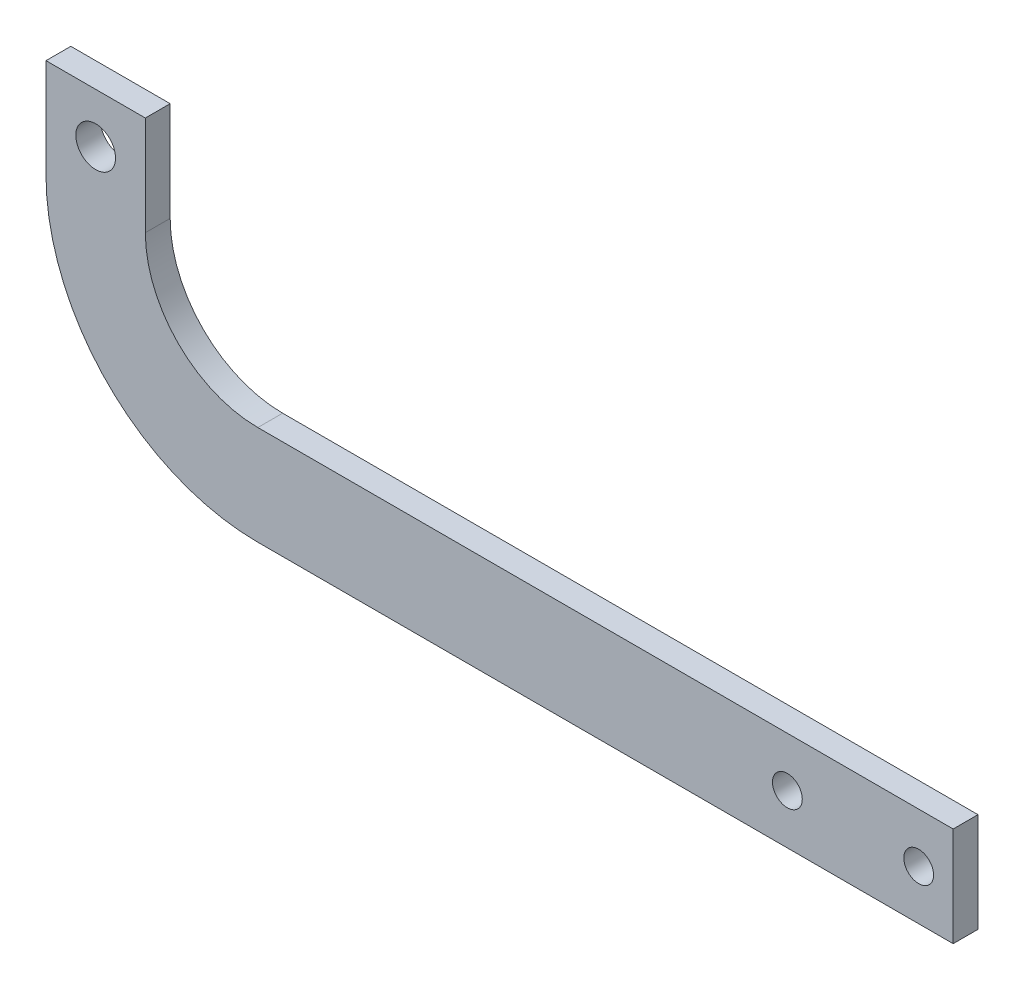
ISO-10303-21;
HEADER;
FILE_DESCRIPTION(('STEP AP214'),'2;1');
FILE_NAME('part.step','',(''),(''),'','','');
FILE_SCHEMA(('AUTOMOTIVE_DESIGN { 1 0 10303 214 1 1 1 1 }'));
ENDSEC;
DATA;
#1=APPLICATION_CONTEXT('core data for automotive mechanical design processes');
#2=APPLICATION_PROTOCOL_DEFINITION('international standard','automotive_design',2000,#1);
#3=PRODUCT_CONTEXT('',#1,'mechanical');
#4=PRODUCT('Part','Part','',(#3));
#5=PRODUCT_RELATED_PRODUCT_CATEGORY('part','',(#4));
#6=PRODUCT_DEFINITION_FORMATION('','',#4);
#7=PRODUCT_DEFINITION_CONTEXT('part definition',#1,'design');
#8=PRODUCT_DEFINITION('design','',#6,#7);
#9=PRODUCT_DEFINITION_SHAPE('','',#8);
#10=(LENGTH_UNIT() NAMED_UNIT(*) SI_UNIT(.MILLI.,.METRE.));
#11=(NAMED_UNIT(*) PLANE_ANGLE_UNIT() SI_UNIT($,.RADIAN.));
#12=(NAMED_UNIT(*) SI_UNIT($,.STERADIAN.) SOLID_ANGLE_UNIT());
#13=UNCERTAINTY_MEASURE_WITH_UNIT(LENGTH_MEASURE(1.E-05),#10,'distance_accuracy_value','');
#14=(GEOMETRIC_REPRESENTATION_CONTEXT(3) GLOBAL_UNCERTAINTY_ASSIGNED_CONTEXT((#13)) GLOBAL_UNIT_ASSIGNED_CONTEXT((#10,
#11,#12)) REPRESENTATION_CONTEXT('',''));
#15=CARTESIAN_POINT('',(0.,0.,0.));
#16=DIRECTION('',(0.,0.,1.));
#17=DIRECTION('',(1.,0.,0.));
#18=AXIS2_PLACEMENT_3D('',#15,#16,#17);
#19=CARTESIAN_POINT('',(0.,21.3237521470741,2.5));
#20=DIRECTION('',(0.,0.,1.));
#21=DIRECTION('',(1.,0.,0.));
#22=AXIS2_PLACEMENT_3D('',#19,#20,#21);
#23=PLANE('',#22);
#24=CARTESIAN_POINT('',(66.53,5.,2.5));
#25=DIRECTION('',(0.,0.,1.));
#26=DIRECTION('',(1.,0.,0.));
#27=AXIS2_PLACEMENT_3D('',#24,#25,#26);
#28=CIRCLE('',#27,1.5);
#29=CARTESIAN_POINT('',(68.03,5.,2.5));
#30=VERTEX_POINT('',#29);
#31=EDGE_CURVE('E182',#30,#30,#28,.T.);
#32=ORIENTED_EDGE('',*,*,#31,.F.);
#33=EDGE_LOOP('',(#32));
#34=FACE_BOUND('',#33,.T.);
#35=CARTESIAN_POINT('',(0.,21.3237521470741,2.5));
#36=DIRECTION('',(0.,0.,1.));
#37=DIRECTION('',(1.,0.,0.));
#38=AXIS2_PLACEMENT_3D('',#35,#36,#37);
#39=CIRCLE('',#38,21.3237521470741);
#40=CARTESIAN_POINT('',(-21.3237521470741,21.3237521470741,2.5));
#41=VERTEX_POINT('',#40);
#42=CARTESIAN_POINT('',(0.,0.,2.5));
#43=VERTEX_POINT('',#42);
#44=EDGE_CURVE('E145',#41,#43,#39,.T.);
#45=ORIENTED_EDGE('',*,*,#44,.T.);
#46=DIRECTION('',(1.,0.,0.));
#47=VECTOR('',#46,1.);
#48=CARTESIAN_POINT('',(0.,0.,2.5));
#49=LINE('',#48,#47);
#50=CARTESIAN_POINT('',(70.,0.,2.5));
#51=VERTEX_POINT('',#50);
#52=EDGE_CURVE('E93',#43,#51,#49,.T.);
#53=ORIENTED_EDGE('',*,*,#52,.T.);
#54=DIRECTION('',(0.,1.,0.));
#55=VECTOR('',#54,1.);
#56=CARTESIAN_POINT('',(70.,0.,2.5));
#57=LINE('',#56,#55);
#58=CARTESIAN_POINT('',(70.,10.,2.5));
#59=VERTEX_POINT('',#58);
#60=EDGE_CURVE('E160',#51,#59,#57,.T.);
#61=ORIENTED_EDGE('',*,*,#60,.T.);
#62=DIRECTION('',(-1.,0.,0.));
#63=VECTOR('',#62,1.);
#64=CARTESIAN_POINT('',(0.,10.,2.5));
#65=LINE('',#64,#63);
#66=CARTESIAN_POINT('',(0.,10.,2.5));
#67=VERTEX_POINT('',#66);
#68=EDGE_CURVE('E173',#59,#67,#65,.T.);
#69=ORIENTED_EDGE('',*,*,#68,.T.);
#70=CARTESIAN_POINT('',(0.,21.3237521470741,2.5));
#71=DIRECTION('',(0.,0.,-1.));
#72=DIRECTION('',(1.,0.,0.));
#73=AXIS2_PLACEMENT_3D('',#70,#71,#72);
#74=CIRCLE('',#73,11.3237521470741);
#75=CARTESIAN_POINT('',(-11.3237521470741,21.3237521470741,2.5));
#76=VERTEX_POINT('',#75);
#77=EDGE_CURVE('E112',#67,#76,#74,.T.);
#78=ORIENTED_EDGE('',*,*,#77,.T.);
#79=DIRECTION('',(0.,1.,0.));
#80=VECTOR('',#79,1.);
#81=CARTESIAN_POINT('',(-11.3237521470741,31.3237521470741,2.5));
#82=LINE('',#81,#80);
#83=CARTESIAN_POINT('',(-11.3237521470741,31.3237521470741,2.5));
#84=VERTEX_POINT('',#83);
#85=EDGE_CURVE('E106',#76,#84,#82,.T.);
#86=ORIENTED_EDGE('',*,*,#85,.T.);
#87=DIRECTION('',(-1.,0.,0.));
#88=VECTOR('',#87,1.);
#89=CARTESIAN_POINT('',(-21.3237521470741,31.3237521470741,2.5));
#90=LINE('',#89,#88);
#91=CARTESIAN_POINT('',(-21.3237521470741,31.3237521470741,2.5));
#92=VERTEX_POINT('',#91);
#93=EDGE_CURVE('E110',#84,#92,#90,.T.);
#94=ORIENTED_EDGE('',*,*,#93,.T.);
#95=DIRECTION('',(0.,-1.,0.));
#96=VECTOR('',#95,1.);
#97=CARTESIAN_POINT('',(-21.3237521470741,21.3237521470741,2.5));
#98=LINE('',#97,#96);
#99=EDGE_CURVE('E50',#92,#41,#98,.T.);
#100=ORIENTED_EDGE('',*,*,#99,.T.);
#101=EDGE_LOOP('',(#45,#53,#61,#69,#78,#86,#94,#100));
#102=FACE_BOUND('',#101,.T.);
#103=CARTESIAN_POINT('',(-16.3237521470741,26.3237521470741,2.5));
#104=DIRECTION('',(0.,0.,1.));
#105=DIRECTION('',(1.,0.,0.));
#106=AXIS2_PLACEMENT_3D('',#103,#104,#105);
#107=CIRCLE('',#106,2.);
#108=CARTESIAN_POINT('',(-14.3237521470741,26.3237521470741,2.5));
#109=VERTEX_POINT('',#108);
#110=EDGE_CURVE('E134',#109,#109,#107,.T.);
#111=ORIENTED_EDGE('',*,*,#110,.F.);
#112=EDGE_LOOP('',(#111));
#113=FACE_BOUND('',#112,.T.);
#114=CARTESIAN_POINT('',(53.31,5.,2.5));
#115=DIRECTION('',(0.,0.,1.));
#116=DIRECTION('',(1.,0.,0.));
#117=AXIS2_PLACEMENT_3D('',#114,#115,#116);
#118=CIRCLE('',#117,1.5);
#119=CARTESIAN_POINT('',(54.81,5.,2.5));
#120=VERTEX_POINT('',#119);
#121=EDGE_CURVE('E188',#120,#120,#118,.T.);
#122=ORIENTED_EDGE('',*,*,#121,.F.);
#123=EDGE_LOOP('',(#122));
#124=FACE_BOUND('',#123,.T.);
#125=ADVANCED_FACE('F33',(#34,#102,#113,#124),#23,.T.);
#126=CARTESIAN_POINT('',(0.,21.3237521470741,0.));
#127=DIRECTION('',(0.,0.,1.));
#128=DIRECTION('',(1.,0.,0.));
#129=AXIS2_PLACEMENT_3D('',#126,#127,#128);
#130=PLANE('',#129);
#131=CARTESIAN_POINT('',(0.,21.3237521470741,0.));
#132=DIRECTION('',(0.,0.,1.));
#133=DIRECTION('',(1.,0.,0.));
#134=AXIS2_PLACEMENT_3D('',#131,#132,#133);
#135=CIRCLE('',#134,21.3237521470741);
#136=CARTESIAN_POINT('',(-21.3237521470741,21.3237521470741,0.));
#137=VERTEX_POINT('',#136);
#138=CARTESIAN_POINT('',(0.,0.,0.));
#139=VERTEX_POINT('',#138);
#140=EDGE_CURVE('E130',#137,#139,#135,.T.);
#141=ORIENTED_EDGE('',*,*,#140,.F.);
#142=DIRECTION('',(0.,-1.,0.));
#143=VECTOR('',#142,1.);
#144=CARTESIAN_POINT('',(-21.3237521470741,21.3237521470741,0.));
#145=LINE('',#144,#143);
#146=CARTESIAN_POINT('',(-21.3237521470741,31.3237521470741,0.));
#147=VERTEX_POINT('',#146);
#148=EDGE_CURVE('E85',#147,#137,#145,.T.);
#149=ORIENTED_EDGE('',*,*,#148,.F.);
#150=DIRECTION('',(-1.,0.,0.));
#151=VECTOR('',#150,1.);
#152=CARTESIAN_POINT('',(-21.3237521470741,31.3237521470741,0.));
#153=LINE('',#152,#151);
#154=CARTESIAN_POINT('',(-11.3237521470741,31.3237521470741,0.));
#155=VERTEX_POINT('',#154);
#156=EDGE_CURVE('E79',#155,#147,#153,.T.);
#157=ORIENTED_EDGE('',*,*,#156,.F.);
#158=DIRECTION('',(0.,1.,0.));
#159=VECTOR('',#158,1.);
#160=CARTESIAN_POINT('',(-11.3237521470741,31.3237521470741,0.));
#161=LINE('',#160,#159);
#162=CARTESIAN_POINT('',(-11.3237521470741,21.3237521470741,0.));
#163=VERTEX_POINT('',#162);
#164=EDGE_CURVE('E120',#163,#155,#161,.T.);
#165=ORIENTED_EDGE('',*,*,#164,.F.);
#166=CARTESIAN_POINT('',(0.,21.3237521470741,0.));
#167=DIRECTION('',(0.,0.,-1.));
#168=DIRECTION('',(1.,0.,0.));
#169=AXIS2_PLACEMENT_3D('',#166,#167,#168);
#170=CIRCLE('',#169,11.3237521470741);
#171=CARTESIAN_POINT('',(0.,10.,0.));
#172=VERTEX_POINT('',#171);
#173=EDGE_CURVE('E140',#172,#163,#170,.T.);
#174=ORIENTED_EDGE('',*,*,#173,.F.);
#175=DIRECTION('',(-1.,0.,0.));
#176=VECTOR('',#175,1.);
#177=CARTESIAN_POINT('',(0.,10.,0.));
#178=LINE('',#177,#176);
#179=CARTESIAN_POINT('',(70.,10.,0.));
#180=VERTEX_POINT('',#179);
#181=EDGE_CURVE('E138',#180,#172,#178,.T.);
#182=ORIENTED_EDGE('',*,*,#181,.F.);
#183=DIRECTION('',(0.,1.,0.));
#184=VECTOR('',#183,1.);
#185=CARTESIAN_POINT('',(70.,0.,0.));
#186=LINE('',#185,#184);
#187=CARTESIAN_POINT('',(70.,0.,0.));
#188=VERTEX_POINT('',#187);
#189=EDGE_CURVE('E136',#188,#180,#186,.T.);
#190=ORIENTED_EDGE('',*,*,#189,.F.);
#191=DIRECTION('',(1.,0.,0.));
#192=VECTOR('',#191,1.);
#193=CARTESIAN_POINT('',(0.,0.,0.));
#194=LINE('',#193,#192);
#195=EDGE_CURVE('E133',#139,#188,#194,.T.);
#196=ORIENTED_EDGE('',*,*,#195,.F.);
#197=EDGE_LOOP('',(#141,#149,#157,#165,#174,#182,#190,#196));
#198=FACE_BOUND('',#197,.T.);
#199=CARTESIAN_POINT('',(-16.3237521470741,26.3237521470741,0.));
#200=DIRECTION('',(0.,0.,1.));
#201=DIRECTION('',(1.,0.,0.));
#202=AXIS2_PLACEMENT_3D('',#199,#200,#201);
#203=CIRCLE('',#202,2.);
#204=CARTESIAN_POINT('',(-14.3237521470741,26.3237521470741,0.));
#205=VERTEX_POINT('',#204);
#206=EDGE_CURVE('E179',#205,#205,#203,.T.);
#207=ORIENTED_EDGE('',*,*,#206,.T.);
#208=EDGE_LOOP('',(#207));
#209=FACE_BOUND('',#208,.T.);
#210=CARTESIAN_POINT('',(66.53,5.,0.));
#211=DIRECTION('',(0.,0.,1.));
#212=DIRECTION('',(1.,0.,0.));
#213=AXIS2_PLACEMENT_3D('',#210,#211,#212);
#214=CIRCLE('',#213,1.5);
#215=CARTESIAN_POINT('',(68.03,5.,0.));
#216=VERTEX_POINT('',#215);
#217=EDGE_CURVE('E185',#216,#216,#214,.T.);
#218=ORIENTED_EDGE('',*,*,#217,.T.);
#219=EDGE_LOOP('',(#218));
#220=FACE_BOUND('',#219,.T.);
#221=CARTESIAN_POINT('',(53.31,5.,0.));
#222=DIRECTION('',(0.,0.,1.));
#223=DIRECTION('',(1.,0.,0.));
#224=AXIS2_PLACEMENT_3D('',#221,#222,#223);
#225=CIRCLE('',#224,1.5);
#226=CARTESIAN_POINT('',(54.81,5.,0.));
#227=VERTEX_POINT('',#226);
#228=EDGE_CURVE('E191',#227,#227,#225,.T.);
#229=ORIENTED_EDGE('',*,*,#228,.T.);
#230=EDGE_LOOP('',(#229));
#231=FACE_BOUND('',#230,.T.);
#232=ADVANCED_FACE('F164',(#198,#209,#220,#231),#130,.F.);
#233=CARTESIAN_POINT('',(0.,21.3237521470741,2.5));
#234=DIRECTION('',(0.,0.,-1.));
#235=DIRECTION('',(-1.,0.,0.));
#236=AXIS2_PLACEMENT_3D('',#233,#234,#235);
#237=CYLINDRICAL_SURFACE('',#236,21.3237521470741);
#238=ORIENTED_EDGE('',*,*,#140,.T.);
#239=DIRECTION('',(0.,0.,-1.));
#240=VECTOR('',#239,1.);
#241=CARTESIAN_POINT('',(0.,0.,2.5));
#242=LINE('',#241,#240);
#243=EDGE_CURVE('E11',#43,#139,#242,.T.);
#244=ORIENTED_EDGE('',*,*,#243,.F.);
#245=ORIENTED_EDGE('',*,*,#44,.F.);
#246=DIRECTION('',(0.,0.,-1.));
#247=VECTOR('',#246,1.);
#248=CARTESIAN_POINT('',(-21.3237521470741,21.3237521470741,2.5));
#249=LINE('',#248,#247);
#250=EDGE_CURVE('E126',#41,#137,#249,.T.);
#251=ORIENTED_EDGE('',*,*,#250,.T.);
#252=EDGE_LOOP('',(#238,#244,#245,#251));
#253=FACE_BOUND('',#252,.T.);
#254=ADVANCED_FACE('F35',(#253),#237,.T.);
#255=CARTESIAN_POINT('',(0.,0.,2.5));
#256=DIRECTION('',(0.,1.,0.));
#257=DIRECTION('',(0.,0.,1.));
#258=AXIS2_PLACEMENT_3D('',#255,#256,#257);
#259=PLANE('',#258);
#260=ORIENTED_EDGE('',*,*,#195,.T.);
#261=DIRECTION('',(0.,0.,-1.));
#262=VECTOR('',#261,1.);
#263=CARTESIAN_POINT('',(70.,0.,2.5));
#264=LINE('',#263,#262);
#265=EDGE_CURVE('E42',#51,#188,#264,.T.);
#266=ORIENTED_EDGE('',*,*,#265,.F.);
#267=ORIENTED_EDGE('',*,*,#52,.F.);
#268=ORIENTED_EDGE('',*,*,#243,.T.);
#269=EDGE_LOOP('',(#260,#266,#267,#268));
#270=FACE_BOUND('',#269,.T.);
#271=ADVANCED_FACE('F224',(#270),#259,.F.);
#272=CARTESIAN_POINT('',(70.,0.,2.5));
#273=DIRECTION('',(-1.,0.,0.));
#274=DIRECTION('',(0.,0.,1.));
#275=AXIS2_PLACEMENT_3D('',#272,#273,#274);
#276=PLANE('',#275);
#277=ORIENTED_EDGE('',*,*,#189,.T.);
#278=DIRECTION('',(0.,0.,-1.));
#279=VECTOR('',#278,1.);
#280=CARTESIAN_POINT('',(70.,10.,2.5));
#281=LINE('',#280,#279);
#282=EDGE_CURVE('E152',#59,#180,#281,.T.);
#283=ORIENTED_EDGE('',*,*,#282,.F.);
#284=ORIENTED_EDGE('',*,*,#60,.F.);
#285=ORIENTED_EDGE('',*,*,#265,.T.);
#286=EDGE_LOOP('',(#277,#283,#284,#285));
#287=FACE_BOUND('',#286,.T.);
#288=ADVANCED_FACE('F158',(#287),#276,.F.);
#289=CARTESIAN_POINT('',(0.,10.,2.5));
#290=DIRECTION('',(0.,-1.,0.));
#291=DIRECTION('',(0.,0.,-1.));
#292=AXIS2_PLACEMENT_3D('',#289,#290,#291);
#293=PLANE('',#292);
#294=ORIENTED_EDGE('',*,*,#181,.T.);
#295=DIRECTION('',(0.,0.,-1.));
#296=VECTOR('',#295,1.);
#297=CARTESIAN_POINT('',(0.,10.,2.5));
#298=LINE('',#297,#296);
#299=EDGE_CURVE('E149',#67,#172,#298,.T.);
#300=ORIENTED_EDGE('',*,*,#299,.F.);
#301=ORIENTED_EDGE('',*,*,#68,.F.);
#302=ORIENTED_EDGE('',*,*,#282,.T.);
#303=EDGE_LOOP('',(#294,#300,#301,#302));
#304=FACE_BOUND('',#303,.T.);
#305=ADVANCED_FACE('F169',(#304),#293,.F.);
#306=CARTESIAN_POINT('',(0.,21.3237521470741,2.5));
#307=DIRECTION('',(0.,0.,-1.));
#308=DIRECTION('',(-1.,0.,0.));
#309=AXIS2_PLACEMENT_3D('',#306,#307,#308);
#310=CYLINDRICAL_SURFACE('',#309,11.3237521470741);
#311=ORIENTED_EDGE('',*,*,#173,.T.);
#312=DIRECTION('',(0.,0.,-1.));
#313=VECTOR('',#312,1.);
#314=CARTESIAN_POINT('',(-11.3237521470741,21.3237521470741,2.5));
#315=LINE('',#314,#313);
#316=EDGE_CURVE('E121',#76,#163,#315,.T.);
#317=ORIENTED_EDGE('',*,*,#316,.F.);
#318=ORIENTED_EDGE('',*,*,#77,.F.);
#319=ORIENTED_EDGE('',*,*,#299,.T.);
#320=EDGE_LOOP('',(#311,#317,#318,#319));
#321=FACE_BOUND('',#320,.T.);
#322=ADVANCED_FACE('F172',(#321),#310,.F.);
#323=CARTESIAN_POINT('',(-11.3237521470741,31.3237521470741,2.5));
#324=DIRECTION('',(-1.,0.,0.));
#325=DIRECTION('',(0.,-1.,0.));
#326=AXIS2_PLACEMENT_3D('',#323,#324,#325);
#327=PLANE('',#326);
#328=ORIENTED_EDGE('',*,*,#164,.T.);
#329=DIRECTION('',(0.,0.,-1.));
#330=VECTOR('',#329,1.);
#331=CARTESIAN_POINT('',(-11.3237521470741,31.3237521470741,2.5));
#332=LINE('',#331,#330);
#333=EDGE_CURVE('E117',#84,#155,#332,.T.);
#334=ORIENTED_EDGE('',*,*,#333,.F.);
#335=ORIENTED_EDGE('',*,*,#85,.F.);
#336=ORIENTED_EDGE('',*,*,#316,.T.);
#337=EDGE_LOOP('',(#328,#334,#335,#336));
#338=FACE_BOUND('',#337,.T.);
#339=ADVANCED_FACE('F118',(#338),#327,.F.);
#340=CARTESIAN_POINT('',(-21.3237521470741,31.3237521470741,2.5));
#341=DIRECTION('',(0.,-1.,0.));
#342=DIRECTION('',(0.,0.,-1.));
#343=AXIS2_PLACEMENT_3D('',#340,#341,#342);
#344=PLANE('',#343);
#345=ORIENTED_EDGE('',*,*,#156,.T.);
#346=DIRECTION('',(0.,0.,-1.));
#347=VECTOR('',#346,1.);
#348=CARTESIAN_POINT('',(-21.3237521470741,31.3237521470741,2.5));
#349=LINE('',#348,#347);
#350=EDGE_CURVE('E122',#92,#147,#349,.T.);
#351=ORIENTED_EDGE('',*,*,#350,.F.);
#352=ORIENTED_EDGE('',*,*,#93,.F.);
#353=ORIENTED_EDGE('',*,*,#333,.T.);
#354=EDGE_LOOP('',(#345,#351,#352,#353));
#355=FACE_BOUND('',#354,.T.);
#356=ADVANCED_FACE('F124',(#355),#344,.F.);
#357=CARTESIAN_POINT('',(-21.3237521470741,21.3237521470741,2.5));
#358=DIRECTION('',(1.,0.,0.));
#359=DIRECTION('',(0.,0.,-1.));
#360=AXIS2_PLACEMENT_3D('',#357,#358,#359);
#361=PLANE('',#360);
#362=ORIENTED_EDGE('',*,*,#148,.T.);
#363=ORIENTED_EDGE('',*,*,#250,.F.);
#364=ORIENTED_EDGE('',*,*,#99,.F.);
#365=ORIENTED_EDGE('',*,*,#350,.T.);
#366=EDGE_LOOP('',(#362,#363,#364,#365));
#367=FACE_BOUND('',#366,.T.);
#368=ADVANCED_FACE('F212',(#367),#361,.F.);
#369=CARTESIAN_POINT('',(-16.3237521470741,26.3237521470741,2.5));
#370=DIRECTION('',(0.,0.,-1.));
#371=DIRECTION('',(-1.,0.,0.));
#372=AXIS2_PLACEMENT_3D('',#369,#370,#371);
#373=CYLINDRICAL_SURFACE('',#372,2.);
#374=ORIENTED_EDGE('',*,*,#110,.T.);
#375=EDGE_LOOP('',(#374));
#376=FACE_BOUND('',#375,.T.);
#377=ORIENTED_EDGE('',*,*,#206,.F.);
#378=EDGE_LOOP('',(#377));
#379=FACE_BOUND('',#378,.T.);
#380=ADVANCED_FACE('F209',(#376,#379),#373,.F.);
#381=CARTESIAN_POINT('',(66.53,5.,2.5));
#382=DIRECTION('',(0.,0.,-1.));
#383=DIRECTION('',(-1.,0.,0.));
#384=AXIS2_PLACEMENT_3D('',#381,#382,#383);
#385=CYLINDRICAL_SURFACE('',#384,1.5);
#386=ORIENTED_EDGE('',*,*,#31,.T.);
#387=EDGE_LOOP('',(#386));
#388=FACE_BOUND('',#387,.T.);
#389=ORIENTED_EDGE('',*,*,#217,.F.);
#390=EDGE_LOOP('',(#389));
#391=FACE_BOUND('',#390,.T.);
#392=ADVANCED_FACE('F288',(#388,#391),#385,.F.);
#393=CARTESIAN_POINT('',(53.31,5.,2.5));
#394=DIRECTION('',(0.,0.,-1.));
#395=DIRECTION('',(-1.,0.,0.));
#396=AXIS2_PLACEMENT_3D('',#393,#394,#395);
#397=CYLINDRICAL_SURFACE('',#396,1.5);
#398=ORIENTED_EDGE('',*,*,#121,.T.);
#399=EDGE_LOOP('',(#398));
#400=FACE_BOUND('',#399,.T.);
#401=ORIENTED_EDGE('',*,*,#228,.F.);
#402=EDGE_LOOP('',(#401));
#403=FACE_BOUND('',#402,.T.);
#404=ADVANCED_FACE('F197',(#400,#403),#397,.F.);
#405=CLOSED_SHELL('',(#125,#232,#254,#271,#288,#305,#322,#339,#356,#368,#380,#392,#404));
#406=MANIFOLD_SOLID_BREP('B2',#405);
#407=ADVANCED_BREP_SHAPE_REPRESENTATION('',(#18,#406),#14);
#408=SHAPE_DEFINITION_REPRESENTATION(#9,#407);
ENDSEC;
END-ISO-10303-21;
